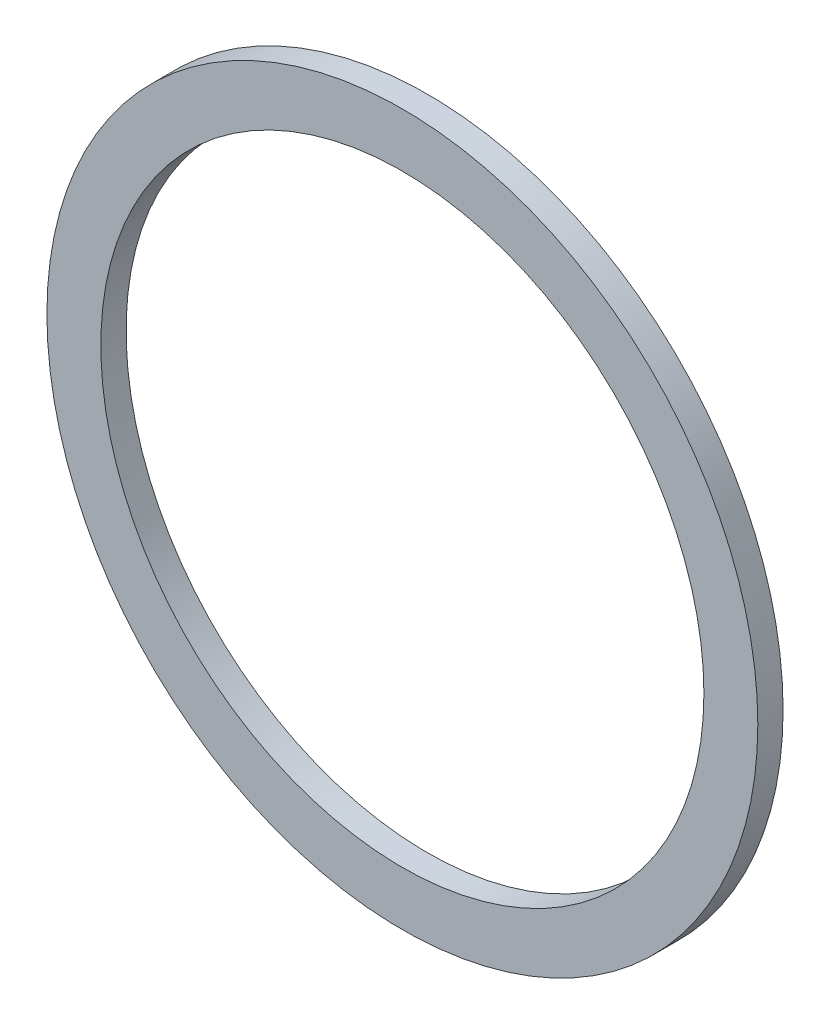
ISO-10303-21;
HEADER;
FILE_DESCRIPTION(('STEP AP214'),'2;1');
FILE_NAME('part.step','',(''),(''),'','','');
FILE_SCHEMA(('AUTOMOTIVE_DESIGN { 1 0 10303 214 1 1 1 1 }'));
ENDSEC;
DATA;
#1=APPLICATION_CONTEXT('core data for automotive mechanical design processes');
#2=APPLICATION_PROTOCOL_DEFINITION('international standard','automotive_design',2000,#1);
#3=PRODUCT_CONTEXT('',#1,'mechanical');
#4=PRODUCT('Part','Part','',(#3));
#5=PRODUCT_RELATED_PRODUCT_CATEGORY('part','',(#4));
#6=PRODUCT_DEFINITION_FORMATION('','',#4);
#7=PRODUCT_DEFINITION_CONTEXT('part definition',#1,'design');
#8=PRODUCT_DEFINITION('design','',#6,#7);
#9=PRODUCT_DEFINITION_SHAPE('','',#8);
#10=(LENGTH_UNIT() NAMED_UNIT(*) SI_UNIT(.MILLI.,.METRE.));
#11=(NAMED_UNIT(*) PLANE_ANGLE_UNIT() SI_UNIT($,.RADIAN.));
#12=(NAMED_UNIT(*) SI_UNIT($,.STERADIAN.) SOLID_ANGLE_UNIT());
#13=UNCERTAINTY_MEASURE_WITH_UNIT(LENGTH_MEASURE(1.E-05),#10,'distance_accuracy_value','');
#14=(GEOMETRIC_REPRESENTATION_CONTEXT(3) GLOBAL_UNCERTAINTY_ASSIGNED_CONTEXT((#13)) GLOBAL_UNIT_ASSIGNED_CONTEXT((#10,
#11,#12)) REPRESENTATION_CONTEXT('',''));
#15=CARTESIAN_POINT('',(0.,0.,0.));
#16=DIRECTION('',(0.,0.,1.));
#17=DIRECTION('',(1.,0.,0.));
#18=AXIS2_PLACEMENT_3D('',#15,#16,#17);
#19=CARTESIAN_POINT('',(0.,0.,0.75));
#20=DIRECTION('',(0.,0.,1.));
#21=DIRECTION('',(1.,0.,0.));
#22=AXIS2_PLACEMENT_3D('',#19,#20,#21);
#23=PLANE('',#22);
#24=CARTESIAN_POINT('',(0.,0.,0.75));
#25=DIRECTION('',(0.,0.,1.));
#26=DIRECTION('',(1.,0.,0.));
#27=AXIS2_PLACEMENT_3D('',#24,#25,#26);
#28=CIRCLE('',#27,10.55);
#29=CARTESIAN_POINT('',(10.55,0.,0.75));
#30=VERTEX_POINT('',#29);
#31=EDGE_CURVE('E10',#30,#30,#28,.T.);
#32=ORIENTED_EDGE('',*,*,#31,.T.);
#33=EDGE_LOOP('',(#32));
#34=FACE_BOUND('',#33,.T.);
#35=CARTESIAN_POINT('',(0.,0.,0.75));
#36=DIRECTION('',(0.,0.,1.));
#37=DIRECTION('',(1.,0.,0.));
#38=AXIS2_PLACEMENT_3D('',#35,#36,#37);
#39=CIRCLE('',#38,8.95);
#40=CARTESIAN_POINT('',(8.95,0.,0.75));
#41=VERTEX_POINT('',#40);
#42=EDGE_CURVE('E47',#41,#41,#39,.T.);
#43=ORIENTED_EDGE('',*,*,#42,.F.);
#44=EDGE_LOOP('',(#43));
#45=FACE_BOUND('',#44,.T.);
#46=ADVANCED_FACE('F36',(#34,#45),#23,.T.);
#47=CARTESIAN_POINT('',(0.,0.,0.));
#48=DIRECTION('',(0.,0.,1.));
#49=DIRECTION('',(1.,0.,0.));
#50=AXIS2_PLACEMENT_3D('',#47,#48,#49);
#51=PLANE('',#50);
#52=CARTESIAN_POINT('',(0.,0.,0.));
#53=DIRECTION('',(0.,0.,1.));
#54=DIRECTION('',(1.,0.,0.));
#55=AXIS2_PLACEMENT_3D('',#52,#53,#54);
#56=CIRCLE('',#55,10.55);
#57=CARTESIAN_POINT('',(10.55,0.,0.));
#58=VERTEX_POINT('',#57);
#59=EDGE_CURVE('E40',#58,#58,#56,.T.);
#60=ORIENTED_EDGE('',*,*,#59,.F.);
#61=EDGE_LOOP('',(#60));
#62=FACE_BOUND('',#61,.T.);
#63=CARTESIAN_POINT('',(0.,0.,0.));
#64=DIRECTION('',(0.,0.,1.));
#65=DIRECTION('',(1.,0.,0.));
#66=AXIS2_PLACEMENT_3D('',#63,#64,#65);
#67=CIRCLE('',#66,8.95);
#68=CARTESIAN_POINT('',(8.95,0.,0.));
#69=VERTEX_POINT('',#68);
#70=EDGE_CURVE('E49',#69,#69,#67,.T.);
#71=ORIENTED_EDGE('',*,*,#70,.T.);
#72=EDGE_LOOP('',(#71));
#73=FACE_BOUND('',#72,.T.);
#74=ADVANCED_FACE('F59',(#62,#73),#51,.F.);
#75=CARTESIAN_POINT('',(0.,0.,0.75));
#76=DIRECTION('',(0.,0.,-1.));
#77=DIRECTION('',(-1.,0.,0.));
#78=AXIS2_PLACEMENT_3D('',#75,#76,#77);
#79=CYLINDRICAL_SURFACE('',#78,10.55);
#80=ORIENTED_EDGE('',*,*,#31,.F.);
#81=EDGE_LOOP('',(#80));
#82=FACE_BOUND('',#81,.T.);
#83=ORIENTED_EDGE('',*,*,#59,.T.);
#84=EDGE_LOOP('',(#83));
#85=FACE_BOUND('',#84,.T.);
#86=ADVANCED_FACE('F38',(#82,#85),#79,.T.);
#87=CARTESIAN_POINT('',(0.,0.,0.75));
#88=DIRECTION('',(0.,0.,-1.));
#89=DIRECTION('',(-1.,0.,0.));
#90=AXIS2_PLACEMENT_3D('',#87,#88,#89);
#91=CYLINDRICAL_SURFACE('',#90,8.95);
#92=ORIENTED_EDGE('',*,*,#42,.T.);
#93=EDGE_LOOP('',(#92));
#94=FACE_BOUND('',#93,.T.);
#95=ORIENTED_EDGE('',*,*,#70,.F.);
#96=EDGE_LOOP('',(#95));
#97=FACE_BOUND('',#96,.T.);
#98=ADVANCED_FACE('F55',(#94,#97),#91,.F.);
#99=CLOSED_SHELL('',(#46,#74,#86,#98));
#100=MANIFOLD_SOLID_BREP('B2',#99);
#101=ADVANCED_BREP_SHAPE_REPRESENTATION('',(#18,#100),#14);
#102=SHAPE_DEFINITION_REPRESENTATION(#9,#101);
ENDSEC;
END-ISO-10303-21;
